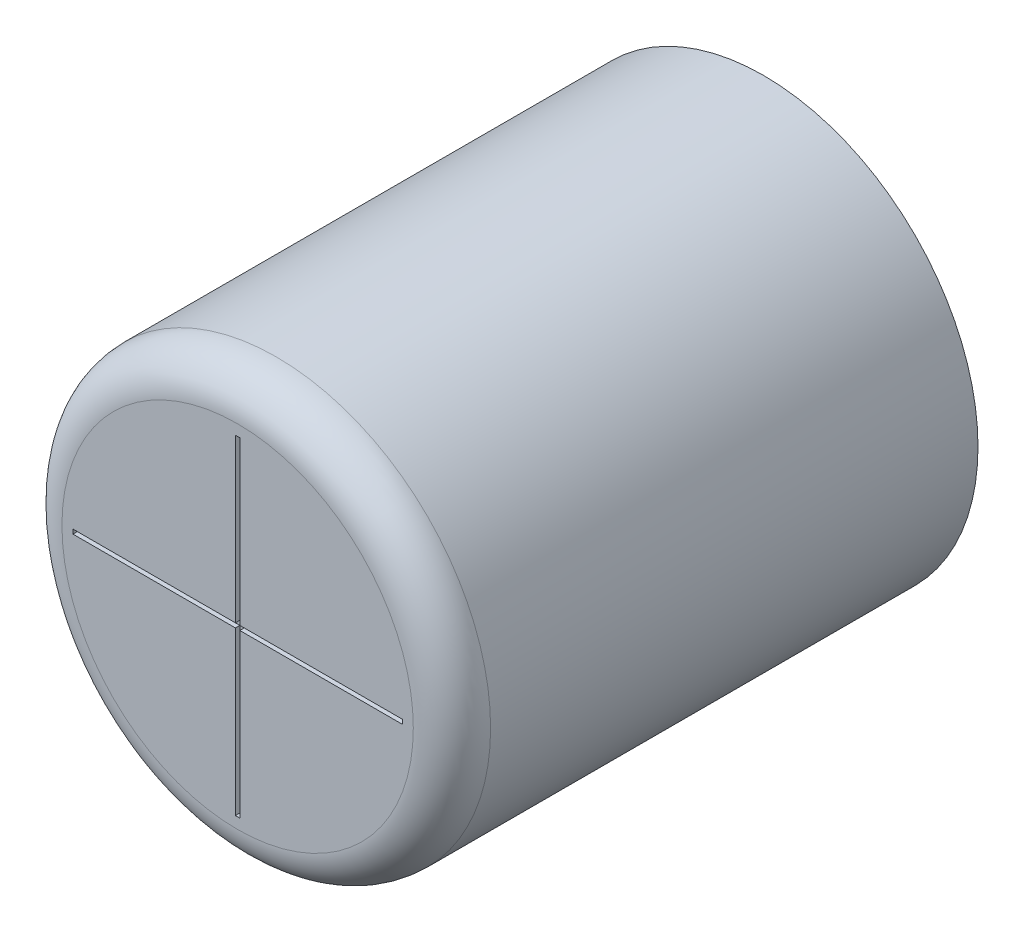
ISO-10303-21;
HEADER;
FILE_DESCRIPTION(('STEP AP214'),'2;1');
FILE_NAME('part.step','',(''),(''),'','','');
FILE_SCHEMA(('AUTOMOTIVE_DESIGN { 1 0 10303 214 1 1 1 1 }'));
ENDSEC;
DATA;
#1=APPLICATION_CONTEXT('core data for automotive mechanical design processes');
#2=APPLICATION_PROTOCOL_DEFINITION('international standard','automotive_design',2000,#1);
#3=PRODUCT_CONTEXT('',#1,'mechanical');
#4=PRODUCT('Part','Part','',(#3));
#5=PRODUCT_RELATED_PRODUCT_CATEGORY('part','',(#4));
#6=PRODUCT_DEFINITION_FORMATION('','',#4);
#7=PRODUCT_DEFINITION_CONTEXT('part definition',#1,'design');
#8=PRODUCT_DEFINITION('design','',#6,#7);
#9=PRODUCT_DEFINITION_SHAPE('','',#8);
#10=(LENGTH_UNIT() NAMED_UNIT(*) SI_UNIT(.MILLI.,.METRE.));
#11=(NAMED_UNIT(*) PLANE_ANGLE_UNIT() SI_UNIT($,.RADIAN.));
#12=(NAMED_UNIT(*) SI_UNIT($,.STERADIAN.) SOLID_ANGLE_UNIT());
#13=UNCERTAINTY_MEASURE_WITH_UNIT(LENGTH_MEASURE(1.E-05),#10,'distance_accuracy_value','');
#14=(GEOMETRIC_REPRESENTATION_CONTEXT(3) GLOBAL_UNCERTAINTY_ASSIGNED_CONTEXT((#13)) GLOBAL_UNIT_ASSIGNED_CONTEXT((#10,
#11,#12)) REPRESENTATION_CONTEXT('',''));
#15=CARTESIAN_POINT('',(0.,0.,0.));
#16=DIRECTION('',(0.,0.,1.));
#17=DIRECTION('',(1.,0.,0.));
#18=AXIS2_PLACEMENT_3D('',#15,#16,#17);
#19=CARTESIAN_POINT('',(-175.270710986926,-62.9180736437963,7.77999999850982));
#20=DIRECTION('',(0.,0.,1.));
#21=DIRECTION('',(1.,0.,0.));
#22=AXIS2_PLACEMENT_3D('',#19,#20,#21);
#23=PLANE('',#22);
#24=DIRECTION('',(0.,1.,0.));
#25=VECTOR('',#24,1.);
#26=CARTESIAN_POINT('',(-175.220710986926,-62.8680736437963,7.77999999850982));
#27=LINE('',#26,#25);
#28=CARTESIAN_POINT('',(-175.220710986926,-62.8680736437963,7.77999999850982));
#29=VERTEX_POINT('',#28);
#30=CARTESIAN_POINT('',(-175.220710986926,-59.1680736437963,7.77999999850982));
#31=VERTEX_POINT('',#30);
#32=EDGE_CURVE('E194',#29,#31,#27,.T.);
#33=ORIENTED_EDGE('',*,*,#32,.T.);
#34=DIRECTION('',(1.,0.,0.));
#35=VECTOR('',#34,1.);
#36=CARTESIAN_POINT('',(-175.220710986926,-59.1680736437963,7.77999999850982));
#37=LINE('',#36,#35);
#38=CARTESIAN_POINT('',(-175.320710986926,-59.1680736437963,7.77999999850982));
#39=VERTEX_POINT('',#38);
#40=EDGE_CURVE('E198',#31,#39,#37,.F.);
#41=ORIENTED_EDGE('',*,*,#40,.T.);
#42=DIRECTION('',(0.,1.,0.));
#43=VECTOR('',#42,1.);
#44=CARTESIAN_POINT('',(-175.320710986926,-59.1680736437963,7.77999999850982));
#45=LINE('',#44,#43);
#46=CARTESIAN_POINT('',(-175.320710986926,-62.8680736437963,7.77999999850982));
#47=VERTEX_POINT('',#46);
#48=EDGE_CURVE('E202',#39,#47,#45,.F.);
#49=ORIENTED_EDGE('',*,*,#48,.T.);
#50=DIRECTION('',(1.,0.,0.));
#51=VECTOR('',#50,1.);
#52=CARTESIAN_POINT('',(-175.320710986926,-62.8680736437963,7.77999999850982));
#53=LINE('',#52,#51);
#54=CARTESIAN_POINT('',(-179.020710986926,-62.8680736437963,7.77999999850982));
#55=VERTEX_POINT('',#54);
#56=EDGE_CURVE('E206',#47,#55,#53,.F.);
#57=ORIENTED_EDGE('',*,*,#56,.T.);
#58=DIRECTION('',(0.,1.,0.));
#59=VECTOR('',#58,1.);
#60=CARTESIAN_POINT('',(-179.020710986926,-62.8680736437963,7.77999999850982));
#61=LINE('',#60,#59);
#62=CARTESIAN_POINT('',(-179.020710986926,-62.9680736437963,7.77999999850982));
#63=VERTEX_POINT('',#62);
#64=EDGE_CURVE('E105',#55,#63,#61,.F.);
#65=ORIENTED_EDGE('',*,*,#64,.T.);
#66=DIRECTION('',(1.,0.,0.));
#67=VECTOR('',#66,1.);
#68=CARTESIAN_POINT('',(-179.020710986926,-62.9680736437963,7.77999999850982));
#69=LINE('',#68,#67);
#70=CARTESIAN_POINT('',(-175.320710986926,-62.9680736437963,7.77999999850982));
#71=VERTEX_POINT('',#70);
#72=EDGE_CURVE('E108',#63,#71,#69,.T.);
#73=ORIENTED_EDGE('',*,*,#72,.T.);
#74=DIRECTION('',(0.,1.,0.));
#75=VECTOR('',#74,1.);
#76=CARTESIAN_POINT('',(-175.320710986926,-62.9680736437963,7.77999999850982));
#77=LINE('',#76,#75);
#78=CARTESIAN_POINT('',(-175.320710986926,-66.6680736437963,7.77999999850982));
#79=VERTEX_POINT('',#78);
#80=EDGE_CURVE('E110',#71,#79,#77,.F.);
#81=ORIENTED_EDGE('',*,*,#80,.T.);
#82=DIRECTION('',(1.,0.,0.));
#83=VECTOR('',#82,1.);
#84=CARTESIAN_POINT('',(-175.270710986926,-66.6680736437963,7.77999999850982));
#85=LINE('',#84,#83);
#86=CARTESIAN_POINT('',(-175.220710986926,-66.6680736437963,7.77999999850982));
#87=VERTEX_POINT('',#86);
#88=EDGE_CURVE('E122',#79,#87,#85,.T.);
#89=ORIENTED_EDGE('',*,*,#88,.T.);
#90=DIRECTION('',(0.,1.,0.));
#91=VECTOR('',#90,1.);
#92=CARTESIAN_POINT('',(-175.220710986926,-66.6680736437963,7.77999999850982));
#93=LINE('',#92,#91);
#94=CARTESIAN_POINT('',(-175.220710986926,-62.9680736437963,7.77999999850982));
#95=VERTEX_POINT('',#94);
#96=EDGE_CURVE('E178',#87,#95,#93,.T.);
#97=ORIENTED_EDGE('',*,*,#96,.T.);
#98=DIRECTION('',(1.,0.,0.));
#99=VECTOR('',#98,1.);
#100=CARTESIAN_POINT('',(-175.220710986926,-62.9680736437963,7.77999999850982));
#101=LINE('',#100,#99);
#102=CARTESIAN_POINT('',(-171.520710986926,-62.9680736437963,7.77999999850982));
#103=VERTEX_POINT('',#102);
#104=EDGE_CURVE('E182',#95,#103,#101,.T.);
#105=ORIENTED_EDGE('',*,*,#104,.T.);
#106=DIRECTION('',(0.,1.,0.));
#107=VECTOR('',#106,1.);
#108=CARTESIAN_POINT('',(-171.520710986926,-62.9680736437963,7.77999999850982));
#109=LINE('',#108,#107);
#110=CARTESIAN_POINT('',(-171.520710986926,-62.8680736437963,7.77999999850982));
#111=VERTEX_POINT('',#110);
#112=EDGE_CURVE('E186',#103,#111,#109,.T.);
#113=ORIENTED_EDGE('',*,*,#112,.T.);
#114=DIRECTION('',(1.,0.,0.));
#115=VECTOR('',#114,1.);
#116=CARTESIAN_POINT('',(-171.520710986926,-62.8680736437963,7.77999999850982));
#117=LINE('',#116,#115);
#118=EDGE_CURVE('E190',#111,#29,#117,.F.);
#119=ORIENTED_EDGE('',*,*,#118,.T.);
#120=EDGE_LOOP('',(#33,#41,#49,#57,#65,#73,#81,#89,#97,#105,#113,#119));
#121=FACE_BOUND('',#120,.T.);
#122=ADVANCED_FACE('F17',(#121),#23,.T.);
#123=CARTESIAN_POINT('',(-175.320710986926,-62.9680736437963,7.87999999999994));
#124=DIRECTION('',(-1.,0.,0.));
#125=DIRECTION('',(0.,0.,1.));
#126=AXIS2_PLACEMENT_3D('',#123,#124,#125);
#127=PLANE('',#126);
#128=DIRECTION('',(0.,1.,0.));
#129=VECTOR('',#128,1.);
#130=CARTESIAN_POINT('',(-175.320710986926,-62.9180736437963,7.87999999999988));
#131=LINE('',#130,#129);
#132=CARTESIAN_POINT('',(-175.320710986926,-66.6680736437963,7.87999999999991));
#133=VERTEX_POINT('',#132);
#134=CARTESIAN_POINT('',(-175.320710986926,-62.9680736437963,7.87999999999991));
#135=VERTEX_POINT('',#134);
#136=EDGE_CURVE('E172',#133,#135,#131,.T.);
#137=ORIENTED_EDGE('',*,*,#136,.F.);
#138=DIRECTION('',(0.,0.,-1.));
#139=VECTOR('',#138,1.);
#140=CARTESIAN_POINT('',(-175.320710986926,-66.6680736437963,7.87999999999994));
#141=LINE('',#140,#139);
#142=EDGE_CURVE('E121',#133,#79,#141,.T.);
#143=ORIENTED_EDGE('',*,*,#142,.T.);
#144=ORIENTED_EDGE('',*,*,#80,.F.);
#145=DIRECTION('',(0.,0.,-1.));
#146=VECTOR('',#145,1.);
#147=CARTESIAN_POINT('',(-175.320710986926,-62.9680736437963,7.87999999999994));
#148=LINE('',#147,#146);
#149=EDGE_CURVE('E115',#71,#135,#148,.F.);
#150=ORIENTED_EDGE('',*,*,#149,.T.);
#151=EDGE_LOOP('',(#137,#143,#144,#150));
#152=FACE_BOUND('',#151,.T.);
#153=ADVANCED_FACE('F118',(#152),#127,.F.);
#154=CARTESIAN_POINT('',(-179.020710986926,-62.9680736437963,7.87999999999994));
#155=DIRECTION('',(0.,-1.,0.));
#156=DIRECTION('',(0.,0.,-1.));
#157=AXIS2_PLACEMENT_3D('',#154,#155,#156);
#158=PLANE('',#157);
#159=DIRECTION('',(1.,0.,0.));
#160=VECTOR('',#159,1.);
#161=CARTESIAN_POINT('',(-173.270710986926,-62.9680736437963,7.87999999999988));
#162=LINE('',#161,#160);
#163=CARTESIAN_POINT('',(-179.020710986926,-62.9680736437963,7.87999999999991));
#164=VERTEX_POINT('',#163);
#165=EDGE_CURVE('E126',#135,#164,#162,.F.);
#166=ORIENTED_EDGE('',*,*,#165,.F.);
#167=ORIENTED_EDGE('',*,*,#149,.F.);
#168=ORIENTED_EDGE('',*,*,#72,.F.);
#169=DIRECTION('',(0.,0.,1.));
#170=VECTOR('',#169,1.);
#171=CARTESIAN_POINT('',(-179.020710986926,-62.9680736437963,7.87999999999994));
#172=LINE('',#171,#170);
#173=EDGE_CURVE('E129',#63,#164,#172,.T.);
#174=ORIENTED_EDGE('',*,*,#173,.T.);
#175=EDGE_LOOP('',(#166,#167,#168,#174));
#176=FACE_BOUND('',#175,.T.);
#177=ADVANCED_FACE('F124',(#176),#158,.F.);
#178=CARTESIAN_POINT('',(-179.020710986926,-62.8680736437963,7.87999999999994));
#179=DIRECTION('',(-1.,0.,0.));
#180=DIRECTION('',(0.,0.,1.));
#181=AXIS2_PLACEMENT_3D('',#178,#179,#180);
#182=PLANE('',#181);
#183=DIRECTION('',(0.,1.,0.));
#184=VECTOR('',#183,1.);
#185=CARTESIAN_POINT('',(-179.020710986926,-62.9180736437963,7.87999999999988));
#186=LINE('',#185,#184);
#187=CARTESIAN_POINT('',(-179.020710986926,-62.8680736437963,7.87999999999991));
#188=VERTEX_POINT('',#187);
#189=EDGE_CURVE('E168',#164,#188,#186,.T.);
#190=ORIENTED_EDGE('',*,*,#189,.F.);
#191=ORIENTED_EDGE('',*,*,#173,.F.);
#192=ORIENTED_EDGE('',*,*,#64,.F.);
#193=DIRECTION('',(0.,0.,1.));
#194=VECTOR('',#193,1.);
#195=CARTESIAN_POINT('',(-179.020710986926,-62.8680736437963,7.87999999999994));
#196=LINE('',#195,#194);
#197=EDGE_CURVE('E204',#55,#188,#196,.T.);
#198=ORIENTED_EDGE('',*,*,#197,.T.);
#199=EDGE_LOOP('',(#190,#191,#192,#198));
#200=FACE_BOUND('',#199,.T.);
#201=ADVANCED_FACE('F209',(#200),#182,.F.);
#202=CARTESIAN_POINT('',(-175.320710986926,-62.8680736437963,7.87999999999994));
#203=DIRECTION('',(0.,1.,0.));
#204=DIRECTION('',(0.,0.,1.));
#205=AXIS2_PLACEMENT_3D('',#202,#203,#204);
#206=PLANE('',#205);
#207=DIRECTION('',(1.,0.,0.));
#208=VECTOR('',#207,1.);
#209=CARTESIAN_POINT('',(-173.270710986926,-62.8680736437963,7.87999999999988));
#210=LINE('',#209,#208);
#211=CARTESIAN_POINT('',(-175.320710986926,-62.8680736437963,7.87999999999991));
#212=VERTEX_POINT('',#211);
#213=EDGE_CURVE('E165',#188,#212,#210,.T.);
#214=ORIENTED_EDGE('',*,*,#213,.F.);
#215=ORIENTED_EDGE('',*,*,#197,.F.);
#216=ORIENTED_EDGE('',*,*,#56,.F.);
#217=DIRECTION('',(0.,0.,1.));
#218=VECTOR('',#217,1.);
#219=CARTESIAN_POINT('',(-175.320710986926,-62.8680736437963,7.87999999999994));
#220=LINE('',#219,#218);
#221=EDGE_CURVE('E200',#47,#212,#220,.T.);
#222=ORIENTED_EDGE('',*,*,#221,.T.);
#223=EDGE_LOOP('',(#214,#215,#216,#222));
#224=FACE_BOUND('',#223,.T.);
#225=ADVANCED_FACE('F250',(#224),#206,.F.);
#226=CARTESIAN_POINT('',(-175.320710986926,-59.1680736437963,7.87999999999994));
#227=DIRECTION('',(-1.,0.,0.));
#228=DIRECTION('',(0.,0.,1.));
#229=AXIS2_PLACEMENT_3D('',#226,#227,#228);
#230=PLANE('',#229);
#231=DIRECTION('',(0.,1.,0.));
#232=VECTOR('',#231,1.);
#233=CARTESIAN_POINT('',(-175.320710986926,-62.9180736437963,7.87999999999988));
#234=LINE('',#233,#232);
#235=CARTESIAN_POINT('',(-175.320710986926,-59.1680736437963,7.87999999999991));
#236=VERTEX_POINT('',#235);
#237=EDGE_CURVE('E162',#212,#236,#234,.T.);
#238=ORIENTED_EDGE('',*,*,#237,.F.);
#239=ORIENTED_EDGE('',*,*,#221,.F.);
#240=ORIENTED_EDGE('',*,*,#48,.F.);
#241=DIRECTION('',(0.,0.,1.));
#242=VECTOR('',#241,1.);
#243=CARTESIAN_POINT('',(-175.320710986926,-59.1680736437963,7.87999999999994));
#244=LINE('',#243,#242);
#245=EDGE_CURVE('E196',#39,#236,#244,.T.);
#246=ORIENTED_EDGE('',*,*,#245,.T.);
#247=EDGE_LOOP('',(#238,#239,#240,#246));
#248=FACE_BOUND('',#247,.T.);
#249=ADVANCED_FACE('F248',(#248),#230,.F.);
#250=CARTESIAN_POINT('',(-175.220710986926,-59.1680736437963,7.87999999999994));
#251=DIRECTION('',(0.,1.,0.));
#252=DIRECTION('',(0.,0.,1.));
#253=AXIS2_PLACEMENT_3D('',#250,#251,#252);
#254=PLANE('',#253);
#255=DIRECTION('',(1.,0.,0.));
#256=VECTOR('',#255,1.);
#257=CARTESIAN_POINT('',(-173.270710986926,-59.1680736437963,7.87999999999988));
#258=LINE('',#257,#256);
#259=CARTESIAN_POINT('',(-175.220710986926,-59.1680736437963,7.87999999999991));
#260=VERTEX_POINT('',#259);
#261=EDGE_CURVE('E159',#236,#260,#258,.T.);
#262=ORIENTED_EDGE('',*,*,#261,.F.);
#263=ORIENTED_EDGE('',*,*,#245,.F.);
#264=ORIENTED_EDGE('',*,*,#40,.F.);
#265=DIRECTION('',(0.,0.,-1.));
#266=VECTOR('',#265,1.);
#267=CARTESIAN_POINT('',(-175.220710986926,-59.1680736437963,7.87999999999994));
#268=LINE('',#267,#266);
#269=EDGE_CURVE('E192',#31,#260,#268,.F.);
#270=ORIENTED_EDGE('',*,*,#269,.T.);
#271=EDGE_LOOP('',(#262,#263,#264,#270));
#272=FACE_BOUND('',#271,.T.);
#273=ADVANCED_FACE('F241',(#272),#254,.F.);
#274=CARTESIAN_POINT('',(-175.220710986926,-62.8680736437963,7.87999999999994));
#275=DIRECTION('',(1.,0.,0.));
#276=DIRECTION('',(0.,0.,-1.));
#277=AXIS2_PLACEMENT_3D('',#274,#275,#276);
#278=PLANE('',#277);
#279=DIRECTION('',(0.,1.,0.));
#280=VECTOR('',#279,1.);
#281=CARTESIAN_POINT('',(-175.220710986926,-62.9180736437963,7.87999999999988));
#282=LINE('',#281,#280);
#283=CARTESIAN_POINT('',(-175.220710986926,-62.8680736437963,7.87999999999991));
#284=VERTEX_POINT('',#283);
#285=EDGE_CURVE('E156',#260,#284,#282,.F.);
#286=ORIENTED_EDGE('',*,*,#285,.F.);
#287=ORIENTED_EDGE('',*,*,#269,.F.);
#288=ORIENTED_EDGE('',*,*,#32,.F.);
#289=DIRECTION('',(0.,0.,1.));
#290=VECTOR('',#289,1.);
#291=CARTESIAN_POINT('',(-175.220710986926,-62.8680736437963,7.87999999999994));
#292=LINE('',#291,#290);
#293=EDGE_CURVE('E188',#29,#284,#292,.T.);
#294=ORIENTED_EDGE('',*,*,#293,.T.);
#295=EDGE_LOOP('',(#286,#287,#288,#294));
#296=FACE_BOUND('',#295,.T.);
#297=ADVANCED_FACE('F238',(#296),#278,.F.);
#298=CARTESIAN_POINT('',(-171.520710986926,-62.8680736437963,7.87999999999994));
#299=DIRECTION('',(0.,1.,0.));
#300=DIRECTION('',(0.,0.,1.));
#301=AXIS2_PLACEMENT_3D('',#298,#299,#300);
#302=PLANE('',#301);
#303=DIRECTION('',(1.,0.,0.));
#304=VECTOR('',#303,1.);
#305=CARTESIAN_POINT('',(-173.270710986926,-62.8680736437963,7.87999999999988));
#306=LINE('',#305,#304);
#307=CARTESIAN_POINT('',(-171.520710986926,-62.8680736437963,7.87999999999991));
#308=VERTEX_POINT('',#307);
#309=EDGE_CURVE('E153',#284,#308,#306,.T.);
#310=ORIENTED_EDGE('',*,*,#309,.F.);
#311=ORIENTED_EDGE('',*,*,#293,.F.);
#312=ORIENTED_EDGE('',*,*,#118,.F.);
#313=DIRECTION('',(0.,0.,-1.));
#314=VECTOR('',#313,1.);
#315=CARTESIAN_POINT('',(-171.520710986926,-62.8680736437963,7.87999999999994));
#316=LINE('',#315,#314);
#317=EDGE_CURVE('E184',#111,#308,#316,.F.);
#318=ORIENTED_EDGE('',*,*,#317,.T.);
#319=EDGE_LOOP('',(#310,#311,#312,#318));
#320=FACE_BOUND('',#319,.T.);
#321=ADVANCED_FACE('F231',(#320),#302,.F.);
#322=CARTESIAN_POINT('',(-171.520710986926,-62.9680736437963,7.87999999999994));
#323=DIRECTION('',(1.,0.,0.));
#324=DIRECTION('',(0.,0.,-1.));
#325=AXIS2_PLACEMENT_3D('',#322,#323,#324);
#326=PLANE('',#325);
#327=DIRECTION('',(0.,1.,0.));
#328=VECTOR('',#327,1.);
#329=CARTESIAN_POINT('',(-171.520710986926,-62.9180736437963,7.87999999999988));
#330=LINE('',#329,#328);
#331=CARTESIAN_POINT('',(-171.520710986926,-62.9680736437963,7.87999999999991));
#332=VERTEX_POINT('',#331);
#333=EDGE_CURVE('E150',#308,#332,#330,.F.);
#334=ORIENTED_EDGE('',*,*,#333,.F.);
#335=ORIENTED_EDGE('',*,*,#317,.F.);
#336=ORIENTED_EDGE('',*,*,#112,.F.);
#337=DIRECTION('',(0.,0.,-1.));
#338=VECTOR('',#337,1.);
#339=CARTESIAN_POINT('',(-171.520710986926,-62.9680736437963,7.87999999999994));
#340=LINE('',#339,#338);
#341=EDGE_CURVE('E180',#103,#332,#340,.F.);
#342=ORIENTED_EDGE('',*,*,#341,.T.);
#343=EDGE_LOOP('',(#334,#335,#336,#342));
#344=FACE_BOUND('',#343,.T.);
#345=ADVANCED_FACE('F228',(#344),#326,.F.);
#346=CARTESIAN_POINT('',(-175.220710986926,-62.9680736437963,7.87999999999994));
#347=DIRECTION('',(0.,-1.,0.));
#348=DIRECTION('',(0.,0.,-1.));
#349=AXIS2_PLACEMENT_3D('',#346,#347,#348);
#350=PLANE('',#349);
#351=DIRECTION('',(1.,0.,0.));
#352=VECTOR('',#351,1.);
#353=CARTESIAN_POINT('',(-173.270710986926,-62.9680736437963,7.87999999999988));
#354=LINE('',#353,#352);
#355=CARTESIAN_POINT('',(-175.220710986926,-62.9680736437963,7.87999999999991));
#356=VERTEX_POINT('',#355);
#357=EDGE_CURVE('E145',#332,#356,#354,.F.);
#358=ORIENTED_EDGE('',*,*,#357,.F.);
#359=ORIENTED_EDGE('',*,*,#341,.F.);
#360=ORIENTED_EDGE('',*,*,#104,.F.);
#361=DIRECTION('',(0.,0.,-1.));
#362=VECTOR('',#361,1.);
#363=CARTESIAN_POINT('',(-175.220710986926,-62.9680736437963,7.87999999999994));
#364=LINE('',#363,#362);
#365=EDGE_CURVE('E176',#95,#356,#364,.F.);
#366=ORIENTED_EDGE('',*,*,#365,.T.);
#367=EDGE_LOOP('',(#358,#359,#360,#366));
#368=FACE_BOUND('',#367,.T.);
#369=ADVANCED_FACE('F221',(#368),#350,.F.);
#370=CARTESIAN_POINT('',(-175.220710986926,-66.6680736437963,7.87999999999994));
#371=DIRECTION('',(1.,0.,0.));
#372=DIRECTION('',(0.,0.,-1.));
#373=AXIS2_PLACEMENT_3D('',#370,#371,#372);
#374=PLANE('',#373);
#375=DIRECTION('',(0.,1.,0.));
#376=VECTOR('',#375,1.);
#377=CARTESIAN_POINT('',(-175.220710986926,-62.9180736437963,7.87999999999988));
#378=LINE('',#377,#376);
#379=CARTESIAN_POINT('',(-175.220710986926,-66.6680736437963,7.87999999999991));
#380=VERTEX_POINT('',#379);
#381=EDGE_CURVE('E141',#356,#380,#378,.F.);
#382=ORIENTED_EDGE('',*,*,#381,.F.);
#383=ORIENTED_EDGE('',*,*,#365,.F.);
#384=ORIENTED_EDGE('',*,*,#96,.F.);
#385=DIRECTION('',(0.,0.,-1.));
#386=VECTOR('',#385,1.);
#387=CARTESIAN_POINT('',(-175.220710986926,-66.6680736437963,7.87999999999994));
#388=LINE('',#387,#386);
#389=EDGE_CURVE('E36',#87,#380,#388,.F.);
#390=ORIENTED_EDGE('',*,*,#389,.T.);
#391=EDGE_LOOP('',(#382,#383,#384,#390));
#392=FACE_BOUND('',#391,.T.);
#393=ADVANCED_FACE('F218',(#392),#374,.F.);
#394=CARTESIAN_POINT('',(-175.320710986926,-66.6680736437963,7.87999999999994));
#395=DIRECTION('',(0.,-1.,0.));
#396=DIRECTION('',(0.,0.,-1.));
#397=AXIS2_PLACEMENT_3D('',#394,#395,#396);
#398=PLANE('',#397);
#399=DIRECTION('',(1.,0.,0.));
#400=VECTOR('',#399,1.);
#401=CARTESIAN_POINT('',(-173.270710986926,-66.6680736437963,7.87999999999988));
#402=LINE('',#401,#400);
#403=EDGE_CURVE('E137',#380,#133,#402,.F.);
#404=ORIENTED_EDGE('',*,*,#403,.F.);
#405=ORIENTED_EDGE('',*,*,#389,.F.);
#406=ORIENTED_EDGE('',*,*,#88,.F.);
#407=ORIENTED_EDGE('',*,*,#142,.F.);
#408=EDGE_LOOP('',(#404,#405,#406,#407));
#409=FACE_BOUND('',#408,.T.);
#410=ADVANCED_FACE('F215',(#409),#398,.F.);
#411=CARTESIAN_POINT('',(-173.270710986926,-62.9180736437963,7.87999999999988));
#412=DIRECTION('',(0.,0.,1.));
#413=DIRECTION('',(1.,0.,0.));
#414=AXIS2_PLACEMENT_3D('',#411,#412,#413);
#415=PLANE('',#414);
#416=ORIENTED_EDGE('',*,*,#381,.T.);
#417=ORIENTED_EDGE('',*,*,#403,.T.);
#418=ORIENTED_EDGE('',*,*,#136,.T.);
#419=ORIENTED_EDGE('',*,*,#165,.T.);
#420=ORIENTED_EDGE('',*,*,#189,.T.);
#421=ORIENTED_EDGE('',*,*,#213,.T.);
#422=ORIENTED_EDGE('',*,*,#237,.T.);
#423=ORIENTED_EDGE('',*,*,#261,.T.);
#424=ORIENTED_EDGE('',*,*,#285,.T.);
#425=ORIENTED_EDGE('',*,*,#309,.T.);
#426=ORIENTED_EDGE('',*,*,#333,.T.);
#427=ORIENTED_EDGE('',*,*,#357,.T.);
#428=EDGE_LOOP('',(#416,#417,#418,#419,#420,#421,#422,#423,#424,#425,#426,#427));
#429=FACE_BOUND('',#428,.T.);
#430=CARTESIAN_POINT('',(-175.270710986926,-62.9180736437963,7.87999999999989));
#431=DIRECTION('',(0.,0.,-1.));
#432=DIRECTION('',(0.,1.,0.));
#433=AXIS2_PLACEMENT_3D('',#430,#431,#432);
#434=CIRCLE('',#433,3.99999999999998);
#435=CARTESIAN_POINT('',(-175.270710986926,-58.9180736437963,7.87999999999989));
#436=VERTEX_POINT('',#435);
#437=EDGE_CURVE('E21',#436,#436,#434,.T.);
#438=ORIENTED_EDGE('',*,*,#437,.F.);
#439=EDGE_LOOP('',(#438));
#440=FACE_BOUND('',#439,.T.);
#441=ADVANCED_FACE('F212',(#429,#440),#415,.T.);
#442=CARTESIAN_POINT('',(-175.270710986926,-62.9180736437962,-4.09683722241655));
#443=DIRECTION('',(0.,0.,1.));
#444=DIRECTION('',(1.,0.,0.));
#445=AXIS2_PLACEMENT_3D('',#442,#443,#444);
#446=PLANE('',#445);
#447=CARTESIAN_POINT('',(-175.270710986926,-62.9180736437963,-4.09683722241616));
#448=DIRECTION('',(0.,0.,1.));
#449=DIRECTION('',(1.,0.,0.));
#450=AXIS2_PLACEMENT_3D('',#447,#448,#449);
#451=CIRCLE('',#450,4.88);
#452=CARTESIAN_POINT('',(-170.390710986926,-62.9180736437963,-4.09683722241616));
#453=VERTEX_POINT('',#452);
#454=EDGE_CURVE('E27',#453,#453,#451,.T.);
#455=ORIENTED_EDGE('',*,*,#454,.F.);
#456=EDGE_LOOP('',(#455));
#457=FACE_BOUND('',#456,.T.);
#458=ADVANCED_FACE('F267',(#457),#446,.F.);
#459=CARTESIAN_POINT('',(-175.270710986926,-62.9180736437963,6.99999999999989));
#460=DIRECTION('',(0.,0.,-1.));
#461=DIRECTION('',(0.,1.,0.));
#462=AXIS2_PLACEMENT_3D('',#459,#460,#461);
#463=TOROIDAL_SURFACE('',#462,4.00000000000001,0.880000000000003);
#464=CARTESIAN_POINT('',(-175.270710986926,-62.9180736437963,6.99999999999989));
#465=DIRECTION('',(0.,0.,1.));
#466=DIRECTION('',(1.,0.,0.));
#467=AXIS2_PLACEMENT_3D('',#464,#465,#466);
#468=CIRCLE('',#467,4.88);
#469=CARTESIAN_POINT('',(-170.390710986926,-62.9180736437963,6.99999999999989));
#470=VERTEX_POINT('',#469);
#471=EDGE_CURVE('E11',#470,#470,#468,.F.);
#472=ORIENTED_EDGE('',*,*,#471,.F.);
#473=EDGE_LOOP('',(#472));
#474=FACE_BOUND('',#473,.T.);
#475=ORIENTED_EDGE('',*,*,#437,.T.);
#476=EDGE_LOOP('',(#475));
#477=FACE_BOUND('',#476,.T.);
#478=ADVANCED_FACE('F19',(#474,#477),#463,.T.);
#479=CARTESIAN_POINT('',(-175.270710986926,-62.9180736437963,1.42682282483722));
#480=DIRECTION('',(0.,0.,1.));
#481=DIRECTION('',(1.,0.,0.));
#482=AXIS2_PLACEMENT_3D('',#479,#480,#481);
#483=CYLINDRICAL_SURFACE('',#482,4.88);
#484=ORIENTED_EDGE('',*,*,#471,.T.);
#485=EDGE_LOOP('',(#484));
#486=FACE_BOUND('',#485,.T.);
#487=ORIENTED_EDGE('',*,*,#454,.T.);
#488=EDGE_LOOP('',(#487));
#489=FACE_BOUND('',#488,.T.);
#490=ADVANCED_FACE('F260',(#486,#489),#483,.T.);
#491=CLOSED_SHELL('',(#122,#153,#177,#201,#225,#249,#273,#297,#321,#345,#369,#393,#410,#441,
#458,#478,#490));
#492=MANIFOLD_SOLID_BREP('B1',#491);
#493=ADVANCED_BREP_SHAPE_REPRESENTATION('',(#18,#492),#14);
#494=SHAPE_DEFINITION_REPRESENTATION(#9,#493);
ENDSEC;
END-ISO-10303-21;
